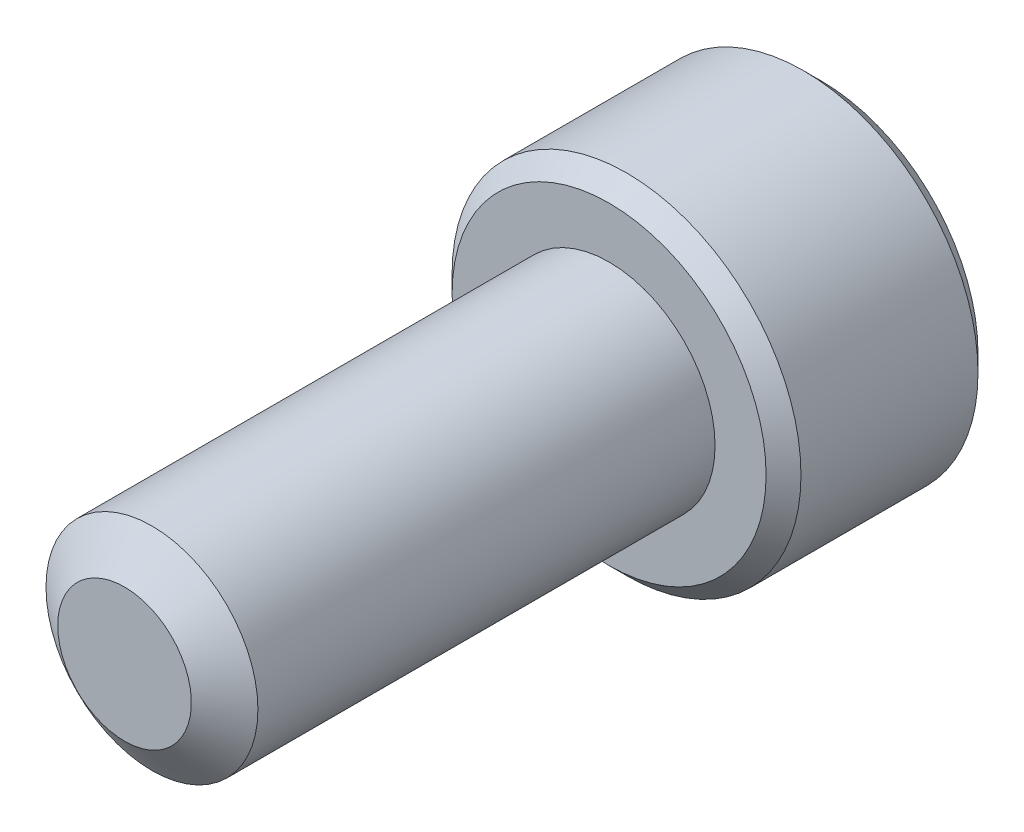
ISO-10303-21;
HEADER;
FILE_DESCRIPTION(('STEP AP214'),'2;1');
FILE_NAME('part.step','',(''),(''),'','','');
FILE_SCHEMA(('AUTOMOTIVE_DESIGN { 1 0 10303 214 1 1 1 1 }'));
ENDSEC;
DATA;
#1=APPLICATION_CONTEXT('core data for automotive mechanical design processes');
#2=APPLICATION_PROTOCOL_DEFINITION('international standard','automotive_design',2000,#1);
#3=PRODUCT_CONTEXT('',#1,'mechanical');
#4=PRODUCT('Part','Part','',(#3));
#5=PRODUCT_RELATED_PRODUCT_CATEGORY('part','',(#4));
#6=PRODUCT_DEFINITION_FORMATION('','',#4);
#7=PRODUCT_DEFINITION_CONTEXT('part definition',#1,'design');
#8=PRODUCT_DEFINITION('design','',#6,#7);
#9=PRODUCT_DEFINITION_SHAPE('','',#8);
#10=(LENGTH_UNIT() NAMED_UNIT(*) SI_UNIT(.MILLI.,.METRE.));
#11=(NAMED_UNIT(*) PLANE_ANGLE_UNIT() SI_UNIT($,.RADIAN.));
#12=(NAMED_UNIT(*) SI_UNIT($,.STERADIAN.) SOLID_ANGLE_UNIT());
#13=UNCERTAINTY_MEASURE_WITH_UNIT(LENGTH_MEASURE(1.E-05),#10,'distance_accuracy_value','');
#14=(GEOMETRIC_REPRESENTATION_CONTEXT(3) GLOBAL_UNCERTAINTY_ASSIGNED_CONTEXT((#13)) GLOBAL_UNIT_ASSIGNED_CONTEXT((#10,
#11,#12)) REPRESENTATION_CONTEXT('',''));
#15=CARTESIAN_POINT('',(0.,0.,0.));
#16=DIRECTION('',(0.,0.,1.));
#17=DIRECTION('',(1.,0.,0.));
#18=AXIS2_PLACEMENT_3D('',#15,#16,#17);
#19=CARTESIAN_POINT('',(-1.7859375,-1.03111149638085,-11.01169375));
#20=DIRECTION('',(-1.,0.,0.));
#21=DIRECTION('',(0.,-1.,0.));
#22=AXIS2_PLACEMENT_3D('',#19,#20,#21);
#23=PLANE('',#22);
#24=CARTESIAN_POINT('',(-1.78593749999427,1.03111149640045,-13.6905999999592));
#25=CARTESIAN_POINT('',(-1.78593749999794,0.96069492309963,-13.6554245652599));
#26=CARTESIAN_POINT('',(-1.78593749999945,0.889108487086667,-13.6223030291579));
#27=CARTESIAN_POINT('',(-1.78593750000056,0.743109337870881,-13.5615905844948));
#28=CARTESIAN_POINT('',(-1.78593750000015,0.66868144433279,-13.534036504538));
#29=CARTESIAN_POINT('',(-1.78593749999985,0.517674563679263,-13.4864565305287));
#30=CARTESIAN_POINT('',(-1.78593749999996,0.441103823295278,-13.4664051587036));
#31=CARTESIAN_POINT('',(-1.78593750000004,0.286283782128012,-13.4355352049639));
#32=CARTESIAN_POINT('',(-1.78593750000001,0.208040449600168,-13.4246880720215));
#33=CARTESIAN_POINT('',(-1.7859375,0.10792666946917,-13.4174419923261));
#34=CARTESIAN_POINT('',(-1.7859375,0.0863521599616257,-13.4162705279671));
#35=CARTESIAN_POINT('',(-1.7859375,0.0431861080408168,-13.4147066436146));
#36=CARTESIAN_POINT('',(-1.7859375,0.0215945812649161,-13.4143138004214));
#37=CARTESIAN_POINT('',(-1.7859375,-0.0541981545622529,-13.414316281021));
#38=CARTESIAN_POINT('',(-1.7859375,-0.108415549697065,-13.4167970706442));
#39=CARTESIAN_POINT('',(-1.7859375,-0.216427473854635,-13.426572896068));
#40=CARTESIAN_POINT('',(-1.7859375,-0.270221681438064,-13.4338712896901));
#41=CARTESIAN_POINT('',(-1.7859375,-0.430887377452918,-13.4625366064611));
#42=CARTESIAN_POINT('',(-1.7859375,-0.536587945955606,-13.4906688034401));
#43=CARTESIAN_POINT('',(-1.7859375,-0.707329338610803,-13.5482200322678));
#44=CARTESIAN_POINT('',(-1.7859375,-0.77376114881228,-13.5738111198643));
#45=CARTESIAN_POINT('',(-1.7859375,-0.904109359640365,-13.6292752635769));
#46=CARTESIAN_POINT('',(-1.7859375,-0.968043209897114,-13.6591070136854));
#47=CARTESIAN_POINT('',(-1.7859375,-1.03111149640136,-13.6905999999565));
#48=B_SPLINE_CURVE_WITH_KNOTS('',3,(#24,#25,#26,#27,#28,#29,#30,#31,#32,#33,#34,#35,#36,#37,#38,
#39,#40,#41,#42,#43,#44,#45,#46,#47),.UNSPECIFIED.,.F.,.F.,(4,2,2,2,2,2,2,2,2,2,2,4),(0.,
0.236303104656893,0.474121562194583,0.711124941876914,0.947390434639868,1.01219957258844,
1.07697347550657,1.23954324052721,1.40222643484617,1.72893676572138,1.94237217080048,
2.15385538573754),.UNSPECIFIED.);
#49=CARTESIAN_POINT('',(-1.78593750000903,1.03111149638606,-13.6905999999567));
#50=VERTEX_POINT('',#49);
#51=CARTESIAN_POINT('',(-1.78593750000903,-1.03111149638606,-13.6905999999567));
#52=VERTEX_POINT('',#51);
#53=EDGE_CURVE('E21',#50,#52,#48,.T.);
#54=ORIENTED_EDGE('',*,*,#53,.F.);
#55=DIRECTION('',(0.,0.,1.));
#56=VECTOR('',#55,1.);
#57=CARTESIAN_POINT('',(-1.7859375,1.03111149638085,-11.01169375));
#58=LINE('',#57,#56);
#59=CARTESIAN_POINT('',(-1.7859375,1.03111149638085,-11.01169375));
#60=VERTEX_POINT('',#59);
#61=EDGE_CURVE('E66',#50,#60,#58,.T.);
#62=ORIENTED_EDGE('',*,*,#61,.T.);
#63=DIRECTION('',(0.,1.,0.));
#64=VECTOR('',#63,1.);
#65=CARTESIAN_POINT('',(-1.7859375,3.09333448914254,-11.01169375));
#66=LINE('',#65,#64);
#67=CARTESIAN_POINT('',(-1.7859375,-1.03111149638085,-11.01169375));
#68=VERTEX_POINT('',#67);
#69=EDGE_CURVE('E71',#68,#60,#66,.T.);
#70=ORIENTED_EDGE('',*,*,#69,.F.);
#71=DIRECTION('',(0.,0.,1.));
#72=VECTOR('',#71,1.);
#73=CARTESIAN_POINT('',(-1.7859375,-1.03111149638085,-11.01169375));
#74=LINE('',#73,#72);
#75=EDGE_CURVE('E69',#68,#52,#74,.F.);
#76=ORIENTED_EDGE('',*,*,#75,.T.);
#77=EDGE_LOOP('',(#54,#62,#70,#76));
#78=FACE_BOUND('',#77,.T.);
#79=ADVANCED_FACE('F17',(#78),#23,.F.);
#80=CARTESIAN_POINT('',(1.7859375,3.09333448914254,-11.01169375));
#81=DIRECTION('',(0.,0.,-1.));
#82=DIRECTION('',(-1.,0.,0.));
#83=AXIS2_PLACEMENT_3D('',#80,#81,#82);
#84=PLANE('',#83);
#85=DIRECTION('',(0.866025403784439,-0.5,0.));
#86=VECTOR('',#85,1.);
#87=CARTESIAN_POINT('',(0.,-2.06222299276169,-11.01169375));
#88=LINE('',#87,#86);
#89=CARTESIAN_POINT('',(0.,-2.06222299276169,-11.01169375));
#90=VERTEX_POINT('',#89);
#91=EDGE_CURVE('E89',#90,#68,#88,.F.);
#92=ORIENTED_EDGE('',*,*,#91,.T.);
#93=ORIENTED_EDGE('',*,*,#69,.T.);
#94=DIRECTION('',(-0.866025403784439,-0.5,0.));
#95=VECTOR('',#94,1.);
#96=CARTESIAN_POINT('',(-1.7859375,1.03111149638085,-11.01169375));
#97=LINE('',#96,#95);
#98=CARTESIAN_POINT('',(0.,2.06222299276169,-11.01169375));
#99=VERTEX_POINT('',#98);
#100=EDGE_CURVE('E88',#60,#99,#97,.F.);
#101=ORIENTED_EDGE('',*,*,#100,.T.);
#102=DIRECTION('',(-0.866025403784439,0.5,0.));
#103=VECTOR('',#102,1.);
#104=CARTESIAN_POINT('',(0.,2.06222299276169,-11.01169375));
#105=LINE('',#104,#103);
#106=CARTESIAN_POINT('',(1.7859375,1.03111149638085,-11.01169375));
#107=VERTEX_POINT('',#106);
#108=EDGE_CURVE('E234',#99,#107,#105,.F.);
#109=ORIENTED_EDGE('',*,*,#108,.T.);
#110=DIRECTION('',(0.,1.,0.));
#111=VECTOR('',#110,1.);
#112=CARTESIAN_POINT('',(1.7859375,1.03111149638085,-11.01169375));
#113=LINE('',#112,#111);
#114=CARTESIAN_POINT('',(1.7859375,-1.03111149638085,-11.01169375));
#115=VERTEX_POINT('',#114);
#116=EDGE_CURVE('E239',#107,#115,#113,.F.);
#117=ORIENTED_EDGE('',*,*,#116,.T.);
#118=DIRECTION('',(0.866025403784439,0.5,0.));
#119=VECTOR('',#118,1.);
#120=CARTESIAN_POINT('',(1.7859375,-1.03111149638085,-11.01169375));
#121=LINE('',#120,#119);
#122=EDGE_CURVE('E244',#115,#90,#121,.F.);
#123=ORIENTED_EDGE('',*,*,#122,.T.);
#124=EDGE_LOOP('',(#92,#93,#101,#109,#117,#123));
#125=FACE_BOUND('',#124,.T.);
#126=ADVANCED_FACE('F169',(#125),#84,.T.);
#127=CARTESIAN_POINT('',(-1.7859375,1.03111149638085,-11.01169375));
#128=DIRECTION('',(-0.5,0.866025403784439,0.));
#129=DIRECTION('',(-0.866025403784439,-0.5,0.));
#130=AXIS2_PLACEMENT_3D('',#127,#128,#129);
#131=PLANE('',#130);
#132=CARTESIAN_POINT('',(-1.78593750001411,1.03111149636608,-13.6905999999592));
#133=CARTESIAN_POINT('',(-1.72455395597439,1.06655130204546,-13.6551942051056));
#134=CARTESIAN_POINT('',(-1.66214407774843,1.10258366204106,-13.6218681955787));
#135=CARTESIAN_POINT('',(-1.53488393140236,1.17605734179235,-13.5608496948344));
#136=CARTESIAN_POINT('',(-1.47002156744873,1.21350564508078,-13.5331911431967));
#137=CARTESIAN_POINT('',(-1.33922979223345,1.28901831170878,-13.4858118580637));
#138=CARTESIAN_POINT('',(-1.27333367173803,1.32706345461549,-13.4659720706649));
#139=CARTESIAN_POINT('',(-1.1400911301283,1.40399107188146,-13.4354050996975));
#140=CARTESIAN_POINT('',(-1.07274877645712,1.44287119790134,-13.4246551075935));
#141=CARTESIAN_POINT('',(-0.956681129260879,1.50988288525428,-13.4149555845176));
#142=CARTESIAN_POINT('',(-0.908105678910242,1.53792793459024,-13.4135201743401));
#143=CARTESIAN_POINT('',(-0.811034250952767,1.59397214965211,-13.4159415300536));
#144=CARTESIAN_POINT('',(-0.762538307165862,1.62197129585208,-13.4198001508996));
#145=CARTESIAN_POINT('',(-0.666017779714094,1.67769744835868,-13.4325882035003));
#146=CARTESIAN_POINT('',(-0.61799362749905,1.70542420556764,-13.4415219038154));
#147=CARTESIAN_POINT('',(-0.522749153321334,1.76041362837297,-13.4639751789819));
#148=CARTESIAN_POINT('',(-0.475529225039516,1.7876760666776,-13.4774969356366));
#149=CARTESIAN_POINT('',(-0.354627809589632,1.85747853143299,-13.5176243107403));
#150=CARTESIAN_POINT('',(-0.28169487520043,1.89958638073539,-13.5472499205808));
#151=CARTESIAN_POINT('',(-0.174452588465536,1.96150274385029,-13.5972605682831));
#152=CARTESIAN_POINT('',(-0.139111351020895,1.98190701680245,-13.6148317843476));
#153=CARTESIAN_POINT('',(-0.0690832544020717,2.02233775723616,-13.6515757306218));
#154=CARTESIAN_POINT('',(-0.0343960099453921,2.04236444716067,-13.6707474793284));
#155=CARTESIAN_POINT('',(1.89934080318623E-11,2.06222299277266,-13.6905999999572));
#156=B_SPLINE_CURVE_WITH_KNOTS('',3,(#132,#133,#134,#135,#136,#137,#138,#139,#140,#141,#142,
#143,#144,#145,#146,#147,#148,#149,#150,#151,#152,#153,#154,#155),.UNSPECIFIED.,.F.,.F.,(4,2,2,
2,2,2,2,2,2,2,2,4),(0.,0.237856418663216,0.477098096720969,0.712541425870698,0.94739220156694,
1.11547935104753,1.28362541097182,1.45191310543146,1.62028093980255,1.88754436627017,
2.02081355613943,2.15400161264314),.UNSPECIFIED.);
#157=CARTESIAN_POINT('',(-3.32158331044238E-12,2.06222299277478,-13.6905999999593));
#158=VERTEX_POINT('',#157);
#159=EDGE_CURVE('E85',#50,#158,#156,.T.);
#160=ORIENTED_EDGE('',*,*,#159,.T.);
#161=DIRECTION('',(0.,0.,1.));
#162=VECTOR('',#161,1.);
#163=CARTESIAN_POINT('',(0.,2.06222299276169,-11.01169375));
#164=LINE('',#163,#162);
#165=EDGE_CURVE('E96',#158,#99,#164,.T.);
#166=ORIENTED_EDGE('',*,*,#165,.T.);
#167=ORIENTED_EDGE('',*,*,#100,.F.);
#168=ORIENTED_EDGE('',*,*,#61,.F.);
#169=EDGE_LOOP('',(#160,#166,#167,#168));
#170=FACE_BOUND('',#169,.T.);
#171=ADVANCED_FACE('F83',(#170),#131,.F.);
#172=CARTESIAN_POINT('',(0.,-2.06222299276169,-11.01169375));
#173=DIRECTION('',(-0.5,-0.866025403784439,0.));
#174=DIRECTION('',(0.866025403784439,-0.5,0.));
#175=AXIS2_PLACEMENT_3D('',#172,#173,#174);
#176=PLANE('',#175);
#177=CARTESIAN_POINT('',(2.08708904245836E-11,-2.06222299276804,-13.6905999999596));
#178=CARTESIAN_POINT('',(-0.0613835440224515,-2.02678318709447,-13.6551942051061));
#179=CARTESIAN_POINT('',(-0.123793422249959,-1.99075082710123,-13.6218681955793));
#180=CARTESIAN_POINT('',(-0.2510535685973,-1.91727714735158,-13.5608496948348));
#181=CARTESIAN_POINT('',(-0.315915932550653,-1.87982884406243,-13.533191143197));
#182=CARTESIAN_POINT('',(-0.446707707765898,-1.80431617743383,-13.4858118580639));
#183=CARTESIAN_POINT('',(-0.51260382826155,-1.76627103452722,-13.465972070665));
#184=CARTESIAN_POINT('',(-0.645846369871614,-1.68934341726121,-13.4354050996975));
#185=CARTESIAN_POINT('',(-0.71318872354289,-1.65046329124121,-13.4246551075935));
#186=CARTESIAN_POINT('',(-0.829256370739265,-1.58345160388816,-13.4149555845176));
#187=CARTESIAN_POINT('',(-0.877831821089922,-1.55540655455221,-13.4135201743401));
#188=CARTESIAN_POINT('',(-0.974903249047429,-1.49936233949032,-13.4159415300537));
#189=CARTESIAN_POINT('',(-1.02339919283435,-1.47136319329034,-13.4198001508996));
#190=CARTESIAN_POINT('',(-1.11991972028614,-1.41563704078372,-13.4325882035003));
#191=CARTESIAN_POINT('',(-1.1679438725012,-1.38791028357476,-13.4415219038154));
#192=CARTESIAN_POINT('',(-1.26318834667893,-1.33292086076942,-13.463975178982));
#193=CARTESIAN_POINT('',(-1.31040827496076,-1.30565842246479,-13.4774969356367));
#194=CARTESIAN_POINT('',(-1.43130969041036,-1.23585595770955,-13.5176243107403));
#195=CARTESIAN_POINT('',(-1.50424262479928,-1.19374810840732,-13.5472499205807));
#196=CARTESIAN_POINT('',(-1.61148491153377,-1.13183174529265,-13.5972605682828));
#197=CARTESIAN_POINT('',(-1.64682614897828,-1.11142747234057,-13.6148317843472));
#198=CARTESIAN_POINT('',(-1.71685424559685,-1.070996731907,-13.6515757306212));
#199=CARTESIAN_POINT('',(-1.7515414900534,-1.05097004198257,-13.6707474793277));
#200=CARTESIAN_POINT('',(-1.78593750001766,-1.03111149637065,-13.6905999999564));
#201=B_SPLINE_CURVE_WITH_KNOTS('',3,(#177,#178,#179,#180,#181,#182,#183,#184,#185,#186,#187,
#188,#189,#190,#191,#192,#193,#194,#195,#196,#197,#198,#199,#200),.UNSPECIFIED.,.F.,.F.,(4,2,2,
2,2,2,2,2,2,2,2,4),(0.,0.237856418663647,0.477098096721859,0.712541425872056,0.947392201568754,
1.11547935104939,1.28362541097373,1.45191310543342,1.62028093980455,1.88754436627113,
2.02081355613988,2.15400161264308),.UNSPECIFIED.);
#202=CARTESIAN_POINT('',(0.,-2.06222299277286,-13.6905999999574));
#203=VERTEX_POINT('',#202);
#204=EDGE_CURVE('E95',#203,#52,#201,.T.);
#205=ORIENTED_EDGE('',*,*,#204,.T.);
#206=ORIENTED_EDGE('',*,*,#75,.F.);
#207=ORIENTED_EDGE('',*,*,#91,.F.);
#208=DIRECTION('',(0.,0.,1.));
#209=VECTOR('',#208,1.);
#210=CARTESIAN_POINT('',(0.,-2.06222299276169,-11.01169375));
#211=LINE('',#210,#209);
#212=EDGE_CURVE('E242',#90,#203,#211,.F.);
#213=ORIENTED_EDGE('',*,*,#212,.T.);
#214=EDGE_LOOP('',(#205,#206,#207,#213));
#215=FACE_BOUND('',#214,.T.);
#216=ADVANCED_FACE('F160',(#215),#176,.F.);
#217=CARTESIAN_POINT('',(1.7859375,-1.03111149638085,-11.01169375));
#218=DIRECTION('',(0.5,-0.866025403784439,0.));
#219=DIRECTION('',(0.866025403784439,0.5,0.));
#220=AXIS2_PLACEMENT_3D('',#217,#218,#219);
#221=PLANE('',#220);
#222=CARTESIAN_POINT('',(1.78593750001593,-1.03111149636595,-13.6905999999596));
#223=CARTESIAN_POINT('',(1.72455395597577,-1.066551302045,-13.6551942051061));
#224=CARTESIAN_POINT('',(1.66214407774956,-1.10258366204049,-13.6218681955793));
#225=CARTESIAN_POINT('',(1.53488393140317,-1.17605734179179,-13.5608496948348));
#226=CARTESIAN_POINT('',(1.47002156744947,-1.21350564508034,-13.533191143197));
#227=CARTESIAN_POINT('',(1.33922979223397,-1.2890183117085,-13.4858118580639));
#228=CARTESIAN_POINT('',(1.27333367173841,-1.32706345461527,-13.465972070665));
#229=CARTESIAN_POINT('',(1.14009113012842,-1.40399107188139,-13.4354050996975));
#230=CARTESIAN_POINT('',(1.07274877645711,-1.44287119790135,-13.4246551075935));
#231=CARTESIAN_POINT('',(0.956681129260728,-1.50988288525437,-13.4149555845176));
#232=CARTESIAN_POINT('',(0.908105678910076,-1.53792793459033,-13.4135201743401));
#233=CARTESIAN_POINT('',(0.811034250952573,-1.59397214965222,-13.4159415300537));
#234=CARTESIAN_POINT('',(0.762538307165654,-1.6219712958522,-13.4198001508996));
#235=CARTESIAN_POINT('',(0.666017779713861,-1.67769744835882,-13.4325882035003));
#236=CARTESIAN_POINT('',(0.617993627498805,-1.70542420556779,-13.4415219038154));
#237=CARTESIAN_POINT('',(0.522749153321068,-1.76041362837313,-13.463975178982));
#238=CARTESIAN_POINT('',(0.475529225039239,-1.78767606667776,-13.4774969356367));
#239=CARTESIAN_POINT('',(0.354627809589398,-1.85747853143313,-13.5176243107404));
#240=CARTESIAN_POINT('',(0.281694875200248,-1.89958638073549,-13.5472499205809));
#241=CARTESIAN_POINT('',(0.174452588465428,-1.96150274385035,-13.5972605682832));
#242=CARTESIAN_POINT('',(0.139111351020809,-1.9819070168025,-13.6148317843477));
#243=CARTESIAN_POINT('',(0.0690832544020305,-2.02233775723619,-13.6515757306219));
#244=CARTESIAN_POINT('',(0.0343960099453724,-2.04236444716068,-13.6707474793284));
#245=CARTESIAN_POINT('',(-1.89920481153364E-11,-2.06222299277266,-13.6905999999572));
#246=B_SPLINE_CURVE_WITH_KNOTS('',3,(#222,#223,#224,#225,#226,#227,#228,#229,#230,#231,#232,
#233,#234,#235,#236,#237,#238,#239,#240,#241,#242,#243,#244,#245),.UNSPECIFIED.,.F.,.F.,(4,2,2,
2,2,2,2,2,2,2,2,4),(0.,0.237856418663652,0.477098096721868,0.712541425872061,0.947392201568756,
1.11547935104939,1.28362541097373,1.45191310543342,1.62028093980456,1.88754436627199,
2.02081355614117,2.1540016126448),.UNSPECIFIED.);
#247=CARTESIAN_POINT('',(1.78593750000967,-1.03111149638643,-13.6905999999574));
#248=VERTEX_POINT('',#247);
#249=EDGE_CURVE('E143',#248,#203,#246,.T.);
#250=ORIENTED_EDGE('',*,*,#249,.T.);
#251=ORIENTED_EDGE('',*,*,#212,.F.);
#252=ORIENTED_EDGE('',*,*,#122,.F.);
#253=DIRECTION('',(0.,0.,1.));
#254=VECTOR('',#253,1.);
#255=CARTESIAN_POINT('',(1.7859375,-1.03111149638085,-11.01169375));
#256=LINE('',#255,#254);
#257=EDGE_CURVE('E237',#115,#248,#256,.F.);
#258=ORIENTED_EDGE('',*,*,#257,.T.);
#259=EDGE_LOOP('',(#250,#251,#252,#258));
#260=FACE_BOUND('',#259,.T.);
#261=ADVANCED_FACE('F156',(#260),#221,.F.);
#262=CARTESIAN_POINT('',(1.7859375,1.03111149638085,-11.01169375));
#263=DIRECTION('',(1.,0.,0.));
#264=DIRECTION('',(0.,1.,0.));
#265=AXIS2_PLACEMENT_3D('',#262,#263,#264);
#266=PLANE('',#265);
#267=CARTESIAN_POINT('',(1.78593749999506,1.0311114964021,-13.6905999999596));
#268=CARTESIAN_POINT('',(1.78593749999822,0.96023188503695,-13.6551942051071));
#269=CARTESIAN_POINT('',(1.78593749999952,0.888167165035615,-13.6218681955817));
#270=CARTESIAN_POINT('',(1.78593750000048,0.741219805509484,-13.5608496948416));
#271=CARTESIAN_POINT('',(1.78593750000013,0.666323198919208,-13.5331911432067));
#272=CARTESIAN_POINT('',(1.78593749999987,0.515297865637936,-13.485811858081));
#273=CARTESIAN_POINT('',(1.78593749999997,0.439207579812643,-13.4659720706867));
#274=CARTESIAN_POINT('',(1.78593750000003,0.285352345257304,-13.4354050997299));
#275=CARTESIAN_POINT('',(1.78593750000001,0.207592093206035,-13.4246551076319));
#276=CARTESIAN_POINT('',(1.78593749999999,0.0735687184737558,-13.4149555845669));
#277=CARTESIAN_POINT('',(1.7859375,0.017478619786673,-13.4135201743946));
#278=CARTESIAN_POINT('',(1.7859375,-0.0946098103668712,-13.4159415301202));
#279=CARTESIAN_POINT('',(1.7859375,-0.150608102781438,-13.419800150973));
#280=CARTESIAN_POINT('',(1.7859375,-0.262060407823213,-13.4325882035887));
#281=CARTESIAN_POINT('',(1.7859375,-0.317513922255084,-13.4415219039119));
#282=CARTESIAN_POINT('',(1.7859375,-0.427492767893014,-13.4639751790954));
#283=CARTESIAN_POINT('',(1.7859375,-0.482017644515583,-13.4774969357589));
#284=CARTESIAN_POINT('',(1.7859375,-0.621622573982271,-13.5176243108634));
#285=CARTESIAN_POINT('',(1.7859375,-0.705838272531852,-13.547249920687));
#286=CARTESIAN_POINT('',(1.7859375,-0.82967099868264,-13.5972605683552));
#287=CARTESIAN_POINT('',(1.7859375,-0.870479544561167,-13.6148317844068));
#288=CARTESIAN_POINT('',(1.7859375,-0.951341025378301,-13.651575730653));
#289=CARTESIAN_POINT('',(1.7859375,-0.991394405202812,-13.6707474793444));
#290=CARTESIAN_POINT('',(1.7859375,-1.03111149640278,-13.6905999999572));
#291=B_SPLINE_CURVE_WITH_KNOTS('',3,(#267,#268,#269,#270,#271,#272,#273,#274,#275,#276,#277,
#278,#279,#280,#281,#282,#283,#284,#285,#286,#287,#288,#289,#290),.UNSPECIFIED.,.F.,.F.,(4,2,2,
2,2,2,2,2,2,2,2,4),(0.,0.237856418695993,0.477098096786559,0.712541425967802,0.947392201695522,
1.11547935122114,1.28362541119053,1.45191310569533,1.62028094011156,1.88754436640769,
2.02081355619067,2.15400161260849),.UNSPECIFIED.);
#292=CARTESIAN_POINT('',(1.78593750000967,1.03111149638643,-13.6905999999574));
#293=VERTEX_POINT('',#292);
#294=EDGE_CURVE('E105',#293,#248,#291,.T.);
#295=ORIENTED_EDGE('',*,*,#294,.T.);
#296=ORIENTED_EDGE('',*,*,#257,.F.);
#297=ORIENTED_EDGE('',*,*,#116,.F.);
#298=DIRECTION('',(0.,0.,1.));
#299=VECTOR('',#298,1.);
#300=CARTESIAN_POINT('',(1.7859375,1.03111149638085,-11.01169375));
#301=LINE('',#300,#299);
#302=EDGE_CURVE('E41',#107,#293,#301,.F.);
#303=ORIENTED_EDGE('',*,*,#302,.T.);
#304=EDGE_LOOP('',(#295,#296,#297,#303));
#305=FACE_BOUND('',#304,.T.);
#306=ADVANCED_FACE('F159',(#305),#266,.F.);
#307=CARTESIAN_POINT('',(0.,2.06222299276169,-11.01169375));
#308=DIRECTION('',(0.5,0.866025403784439,0.));
#309=DIRECTION('',(-0.866025403784439,0.5,0.));
#310=AXIS2_PLACEMENT_3D('',#307,#308,#309);
#311=PLANE('',#310);
#312=CARTESIAN_POINT('',(-2.08696839220087E-11,2.06222299276804,-13.6905999999596));
#313=CARTESIAN_POINT('',(0.0613835440224534,2.02678318709447,-13.6551942051061));
#314=CARTESIAN_POINT('',(0.123793422249962,1.99075082710122,-13.6218681955793));
#315=CARTESIAN_POINT('',(0.251053568597306,1.91727714735158,-13.5608496948348));
#316=CARTESIAN_POINT('',(0.315915932550659,1.87982884406243,-13.533191143197));
#317=CARTESIAN_POINT('',(0.446707707765905,1.80431617743382,-13.4858118580639));
#318=CARTESIAN_POINT('',(0.512603828261555,1.76627103452721,-13.465972070665));
#319=CARTESIAN_POINT('',(0.645846369871617,1.68934341726121,-13.4354050996975));
#320=CARTESIAN_POINT('',(0.713188723542892,1.65046329124121,-13.4246551075935));
#321=CARTESIAN_POINT('',(0.829256370739266,1.58345160388816,-13.4149555845176));
#322=CARTESIAN_POINT('',(0.877831821089921,1.55540655455221,-13.4135201743401));
#323=CARTESIAN_POINT('',(0.974903249047428,1.49936233949032,-13.4159415300537));
#324=CARTESIAN_POINT('',(1.02339919283435,1.47136319329034,-13.4198001508996));
#325=CARTESIAN_POINT('',(1.11991972028614,1.41563704078372,-13.4325882035003));
#326=CARTESIAN_POINT('',(1.16794387250119,1.38791028357476,-13.4415219038154));
#327=CARTESIAN_POINT('',(1.26318834667893,1.33292086076942,-13.463975178982));
#328=CARTESIAN_POINT('',(1.31040827496076,1.30565842246479,-13.4774969356367));
#329=CARTESIAN_POINT('',(1.4313096904106,1.23585595770941,-13.5176243107404));
#330=CARTESIAN_POINT('',(1.50424262479975,1.19374810840705,-13.5472499205809));
#331=CARTESIAN_POINT('',(1.61148491153457,1.13183174529219,-13.5972605682832));
#332=CARTESIAN_POINT('',(1.64682614897919,1.11142747234004,-13.6148317843477));
#333=CARTESIAN_POINT('',(1.71685424559797,1.07099673190636,-13.6515757306219));
#334=CARTESIAN_POINT('',(1.75154149005463,1.05097004198186,-13.6707474793284));
#335=CARTESIAN_POINT('',(1.78593750001899,1.03111149636988,-13.6905999999572));
#336=B_SPLINE_CURVE_WITH_KNOTS('',3,(#312,#313,#314,#315,#316,#317,#318,#319,#320,#321,#322,
#323,#324,#325,#326,#327,#328,#329,#330,#331,#332,#333,#334,#335),.UNSPECIFIED.,.F.,.F.,(4,2,2,
2,2,2,2,2,2,2,2,4),(0.,0.237856418663652,0.477098096721867,0.71254142587206,0.947392201568754,
1.11547935104939,1.28362541097373,1.45191310543342,1.62028093980455,1.88754436627199,
2.02081355614117,2.1540016126448),.UNSPECIFIED.);
#337=EDGE_CURVE('E103',#158,#293,#336,.T.);
#338=ORIENTED_EDGE('',*,*,#337,.T.);
#339=ORIENTED_EDGE('',*,*,#302,.F.);
#340=ORIENTED_EDGE('',*,*,#108,.F.);
#341=ORIENTED_EDGE('',*,*,#165,.F.);
#342=EDGE_LOOP('',(#338,#339,#340,#341));
#343=FACE_BOUND('',#342,.T.);
#344=ADVANCED_FACE('F122',(#343),#311,.F.);
#345=CARTESIAN_POINT('',(0.,0.,-13.6905999999044));
#346=DIRECTION('',(0.,0.,-1.));
#347=DIRECTION('',(-1.,0.,0.));
#348=AXIS2_PLACEMENT_3D('',#345,#346,#347);
#349=CONICAL_SURFACE('',#348,2.06222299271985,0.785398163397448);
#350=ORIENTED_EDGE('',*,*,#159,.F.);
#351=CARTESIAN_POINT('',(0.,0.,-13.6905999999613));
#352=DIRECTION('',(0.,0.,-1.));
#353=DIRECTION('',(-1.,0.,0.));
#354=AXIS2_PLACEMENT_3D('',#351,#352,#353);
#355=CIRCLE('',#354,2.0622229927767);
#356=EDGE_CURVE('E79',#158,#50,#355,.F.);
#357=ORIENTED_EDGE('',*,*,#356,.F.);
#358=EDGE_LOOP('',(#350,#357));
#359=FACE_BOUND('',#358,.T.);
#360=ADVANCED_FACE('F93',(#359),#349,.F.);
#361=CARTESIAN_POINT('',(0.,0.,-13.6905999999044));
#362=DIRECTION('',(0.,0.,-1.));
#363=DIRECTION('',(-1.,0.,0.));
#364=AXIS2_PLACEMENT_3D('',#361,#362,#363);
#365=CONICAL_SURFACE('',#364,2.06222299271985,0.785398163397448);
#366=ORIENTED_EDGE('',*,*,#53,.T.);
#367=CARTESIAN_POINT('',(0.,0.,-13.6905999999613));
#368=DIRECTION('',(0.,0.,-1.));
#369=DIRECTION('',(-1.,0.,0.));
#370=AXIS2_PLACEMENT_3D('',#367,#368,#369);
#371=CIRCLE('',#370,2.0622229927767);
#372=EDGE_CURVE('E73',#50,#52,#371,.F.);
#373=ORIENTED_EDGE('',*,*,#372,.F.);
#374=EDGE_LOOP('',(#366,#373));
#375=FACE_BOUND('',#374,.T.);
#376=ADVANCED_FACE('F74',(#375),#365,.F.);
#377=CARTESIAN_POINT('',(0.,0.,-13.6905999999044));
#378=DIRECTION('',(0.,0.,-1.));
#379=DIRECTION('',(-1.,0.,0.));
#380=AXIS2_PLACEMENT_3D('',#377,#378,#379);
#381=CONICAL_SURFACE('',#380,2.06222299271985,0.785398163397448);
#382=ORIENTED_EDGE('',*,*,#204,.F.);
#383=CARTESIAN_POINT('',(0.,0.,-13.6905999999613));
#384=DIRECTION('',(0.,0.,-1.));
#385=DIRECTION('',(-1.,0.,0.));
#386=AXIS2_PLACEMENT_3D('',#383,#384,#385);
#387=CIRCLE('',#386,2.0622229927767);
#388=EDGE_CURVE('E78',#52,#203,#387,.F.);
#389=ORIENTED_EDGE('',*,*,#388,.F.);
#390=EDGE_LOOP('',(#382,#389));
#391=FACE_BOUND('',#390,.T.);
#392=ADVANCED_FACE('F140',(#391),#381,.F.);
#393=CARTESIAN_POINT('',(0.,0.,-13.6905999999044));
#394=DIRECTION('',(0.,0.,-1.));
#395=DIRECTION('',(-1.,0.,0.));
#396=AXIS2_PLACEMENT_3D('',#393,#394,#395);
#397=CONICAL_SURFACE('',#396,2.06222299271985,0.785398163397448);
#398=ORIENTED_EDGE('',*,*,#249,.F.);
#399=CARTESIAN_POINT('',(0.,0.,-13.6905999999613));
#400=DIRECTION('',(0.,0.,-1.));
#401=DIRECTION('',(-1.,0.,0.));
#402=AXIS2_PLACEMENT_3D('',#399,#400,#401);
#403=CIRCLE('',#402,2.0622229927767);
#404=EDGE_CURVE('E285',#203,#248,#403,.F.);
#405=ORIENTED_EDGE('',*,*,#404,.F.);
#406=EDGE_LOOP('',(#398,#405));
#407=FACE_BOUND('',#406,.T.);
#408=ADVANCED_FACE('F135',(#407),#397,.F.);
#409=CARTESIAN_POINT('',(0.,0.,-13.6905999999044));
#410=DIRECTION('',(0.,0.,-1.));
#411=DIRECTION('',(-1.,0.,0.));
#412=AXIS2_PLACEMENT_3D('',#409,#410,#411);
#413=CONICAL_SURFACE('',#412,2.06222299271985,0.785398163499701);
#414=ORIENTED_EDGE('',*,*,#294,.F.);
#415=CARTESIAN_POINT('',(0.,0.,-13.6905999999613));
#416=DIRECTION('',(0.,0.,-1.));
#417=DIRECTION('',(-1.,0.,0.));
#418=AXIS2_PLACEMENT_3D('',#415,#416,#417);
#419=CIRCLE('',#418,2.0622229927767);
#420=EDGE_CURVE('E283',#248,#293,#419,.F.);
#421=ORIENTED_EDGE('',*,*,#420,.F.);
#422=EDGE_LOOP('',(#414,#421));
#423=FACE_BOUND('',#422,.T.);
#424=ADVANCED_FACE('F129',(#423),#413,.F.);
#425=CARTESIAN_POINT('',(0.,0.,-13.6905999999044));
#426=DIRECTION('',(0.,0.,-1.));
#427=DIRECTION('',(-1.,0.,0.));
#428=AXIS2_PLACEMENT_3D('',#425,#426,#427);
#429=CONICAL_SURFACE('',#428,2.06222299271985,0.785398163397448);
#430=ORIENTED_EDGE('',*,*,#337,.F.);
#431=CARTESIAN_POINT('',(0.,0.,-13.6905999999613));
#432=DIRECTION('',(0.,0.,-1.));
#433=DIRECTION('',(-1.,0.,0.));
#434=AXIS2_PLACEMENT_3D('',#431,#432,#433);
#435=CIRCLE('',#434,2.0622229927767);
#436=EDGE_CURVE('E102',#293,#158,#435,.F.);
#437=ORIENTED_EDGE('',*,*,#436,.F.);
#438=EDGE_LOOP('',(#430,#437));
#439=FACE_BOUND('',#438,.T.);
#440=ADVANCED_FACE('F125',(#439),#429,.F.);
#441=CARTESIAN_POINT('',(0.,0.,-13.6906));
#442=DIRECTION('',(0.,0.,-1.));
#443=DIRECTION('',(-1.,0.,0.));
#444=AXIS2_PLACEMENT_3D('',#441,#442,#443);
#445=PLANE('',#444);
#446=ORIENTED_EDGE('',*,*,#420,.T.);
#447=ORIENTED_EDGE('',*,*,#436,.T.);
#448=ORIENTED_EDGE('',*,*,#356,.T.);
#449=ORIENTED_EDGE('',*,*,#372,.T.);
#450=ORIENTED_EDGE('',*,*,#388,.T.);
#451=ORIENTED_EDGE('',*,*,#404,.T.);
#452=EDGE_LOOP('',(#446,#447,#448,#449,#450,#451));
#453=FACE_BOUND('',#452,.T.);
#454=CARTESIAN_POINT('',(0.,0.,-13.6906000000181));
#455=DIRECTION('',(0.,0.,1.));
#456=DIRECTION('',(0.,-1.,0.));
#457=AXIS2_PLACEMENT_3D('',#454,#455,#456);
#458=CIRCLE('',#457,3.08610000001863);
#459=CARTESIAN_POINT('',(0.,-3.08610000001863,-13.6906000000181));
#460=VERTEX_POINT('',#459);
#461=EDGE_CURVE('E219',#460,#460,#458,.T.);
#462=ORIENTED_EDGE('',*,*,#461,.F.);
#463=EDGE_LOOP('',(#462));
#464=FACE_BOUND('',#463,.T.);
#465=ADVANCED_FACE('F99',(#453,#464),#445,.T.);
#466=CARTESIAN_POINT('',(0.,0.,-13.3476999999402));
#467=DIRECTION('',(0.,0.,1.));
#468=DIRECTION('',(0.,-1.,0.));
#469=AXIS2_PLACEMENT_3D('',#466,#467,#468);
#470=CONICAL_SURFACE('',#469,3.42900000009649,0.785398163397448);
#471=ORIENTED_EDGE('',*,*,#461,.T.);
#472=EDGE_LOOP('',(#471));
#473=FACE_BOUND('',#472,.T.);
#474=CARTESIAN_POINT('',(0.,0.,-13.3477));
#475=DIRECTION('',(0.,0.,1.));
#476=DIRECTION('',(1.,0.,0.));
#477=AXIS2_PLACEMENT_3D('',#474,#475,#476);
#478=CIRCLE('',#477,3.429);
#479=CARTESIAN_POINT('',(3.429,0.,-13.3477));
#480=VERTEX_POINT('',#479);
#481=EDGE_CURVE('E222',#480,#480,#478,.T.);
#482=ORIENTED_EDGE('',*,*,#481,.F.);
#483=EDGE_LOOP('',(#482));
#484=FACE_BOUND('',#483,.T.);
#485=ADVANCED_FACE('F209',(#473,#484),#470,.T.);
#486=CARTESIAN_POINT('',(0.,0.,-13.6906));
#487=DIRECTION('',(0.,0.,1.));
#488=DIRECTION('',(1.,0.,0.));
#489=AXIS2_PLACEMENT_3D('',#486,#487,#488);
#490=CYLINDRICAL_SURFACE('',#489,3.429);
#491=ORIENTED_EDGE('',*,*,#481,.T.);
#492=EDGE_LOOP('',(#491));
#493=FACE_BOUND('',#492,.T.);
#494=CARTESIAN_POINT('',(0.,0.,-9.86790000007431));
#495=DIRECTION('',(0.,0.,-1.));
#496=DIRECTION('',(-1.,0.,0.));
#497=AXIS2_PLACEMENT_3D('',#494,#495,#496);
#498=CIRCLE('',#497,3.42899999998281);
#499=CARTESIAN_POINT('',(-3.42899999998281,0.,-9.86790000007431));
#500=VERTEX_POINT('',#499);
#501=EDGE_CURVE('E223',#500,#500,#498,.F.);
#502=ORIENTED_EDGE('',*,*,#501,.F.);
#503=EDGE_LOOP('',(#502));
#504=FACE_BOUND('',#503,.T.);
#505=ADVANCED_FACE('F206',(#493,#504),#490,.T.);
#506=CARTESIAN_POINT('',(0.,0.,-9.86790000007431));
#507=DIRECTION('',(0.,0.,-1.));
#508=DIRECTION('',(-1.,0.,0.));
#509=AXIS2_PLACEMENT_3D('',#506,#507,#508);
#510=CONICAL_SURFACE('',#509,3.42899999998281,0.785398163397448);
#511=CARTESIAN_POINT('',(0.,0.,-9.5250000000533));
#512=DIRECTION('',(0.,0.,-1.));
#513=DIRECTION('',(-1.,0.,0.));
#514=AXIS2_PLACEMENT_3D('',#511,#512,#513);
#515=CIRCLE('',#514,3.08609999996179);
#516=CARTESIAN_POINT('',(-3.08609999996179,0.,-9.5250000000533));
#517=VERTEX_POINT('',#516);
#518=EDGE_CURVE('E226',#517,#517,#515,.T.);
#519=ORIENTED_EDGE('',*,*,#518,.T.);
#520=EDGE_LOOP('',(#519));
#521=FACE_BOUND('',#520,.T.);
#522=ORIENTED_EDGE('',*,*,#501,.T.);
#523=EDGE_LOOP('',(#522));
#524=FACE_BOUND('',#523,.T.);
#525=ADVANCED_FACE('F202',(#521,#524),#510,.T.);
#526=CARTESIAN_POINT('',(0.,0.,0.));
#527=DIRECTION('',(0.,0.,1.));
#528=DIRECTION('',(1.,0.,0.));
#529=AXIS2_PLACEMENT_3D('',#526,#527,#528);
#530=PLANE('',#529);
#531=CARTESIAN_POINT('',(0.,0.,0.));
#532=DIRECTION('',(0.,0.,-1.));
#533=DIRECTION('',(-1.,0.,0.));
#534=AXIS2_PLACEMENT_3D('',#531,#532,#533);
#535=CIRCLE('',#534,1.31324425183266);
#536=CARTESIAN_POINT('',(-1.31324425183266,0.,0.));
#537=VERTEX_POINT('',#536);
#538=EDGE_CURVE('E277',#537,#537,#535,.T.);
#539=ORIENTED_EDGE('',*,*,#538,.F.);
#540=EDGE_LOOP('',(#539));
#541=FACE_BOUND('',#540,.T.);
#542=ADVANCED_FACE('F198',(#541),#530,.T.);
#543=CARTESIAN_POINT('',(0.,0.,-9.525));
#544=DIRECTION('',(0.,0.,-1.));
#545=DIRECTION('',(-1.,0.,0.));
#546=AXIS2_PLACEMENT_3D('',#543,#544,#545);
#547=PLANE('',#546);
#548=CARTESIAN_POINT('',(0.,0.,-9.525));
#549=DIRECTION('',(0.,0.,1.));
#550=DIRECTION('',(1.,0.,0.));
#551=AXIS2_PLACEMENT_3D('',#548,#549,#550);
#552=CIRCLE('',#551,2.0828);
#553=CARTESIAN_POINT('',(2.0828,0.,-9.525));
#554=VERTEX_POINT('',#553);
#555=EDGE_CURVE('E32',#554,#554,#552,.T.);
#556=ORIENTED_EDGE('',*,*,#555,.F.);
#557=EDGE_LOOP('',(#556));
#558=FACE_BOUND('',#557,.T.);
#559=ORIENTED_EDGE('',*,*,#518,.F.);
#560=EDGE_LOOP('',(#559));
#561=FACE_BOUND('',#560,.T.);
#562=ADVANCED_FACE('F191',(#558,#561),#547,.F.);
#563=CARTESIAN_POINT('',(0.,0.,-0.53884873602783));
#564=DIRECTION('',(0.,0.,-1.));
#565=DIRECTION('',(-1.,0.,0.));
#566=AXIS2_PLACEMENT_3D('',#563,#564,#565);
#567=CONICAL_SURFACE('',#566,2.08280000003924,0.959931088543722);
#568=CARTESIAN_POINT('',(0.,0.,-0.538848735955548));
#569=DIRECTION('',(0.,0.,1.));
#570=DIRECTION('',(1.,0.,0.));
#571=AXIS2_PLACEMENT_3D('',#568,#569,#570);
#572=CIRCLE('',#571,2.0828);
#573=CARTESIAN_POINT('',(2.0828,0.,-0.538848735955548));
#574=VERTEX_POINT('',#573);
#575=EDGE_CURVE('E11',#574,#574,#572,.F.);
#576=ORIENTED_EDGE('',*,*,#575,.F.);
#577=EDGE_LOOP('',(#576));
#578=FACE_BOUND('',#577,.T.);
#579=ORIENTED_EDGE('',*,*,#538,.T.);
#580=EDGE_LOOP('',(#579));
#581=FACE_BOUND('',#580,.T.);
#582=ADVANCED_FACE('F185',(#578,#581),#567,.T.);
#583=CARTESIAN_POINT('',(0.,0.,-9.525));
#584=DIRECTION('',(0.,0.,1.));
#585=DIRECTION('',(1.,0.,0.));
#586=AXIS2_PLACEMENT_3D('',#583,#584,#585);
#587=CYLINDRICAL_SURFACE('',#586,2.0828);
#588=ORIENTED_EDGE('',*,*,#575,.T.);
#589=EDGE_LOOP('',(#588));
#590=FACE_BOUND('',#589,.T.);
#591=ORIENTED_EDGE('',*,*,#555,.T.);
#592=EDGE_LOOP('',(#591));
#593=FACE_BOUND('',#592,.T.);
#594=ADVANCED_FACE('F183',(#590,#593),#587,.T.);
#595=CLOSED_SHELL('',(#79,#126,#171,#216,#261,#306,#344,#360,#376,#392,#408,#424,#440,#465,#485,
#505,#525,#542,#562,#582,#594));
#596=MANIFOLD_SOLID_BREP('B1',#595);
#597=ADVANCED_BREP_SHAPE_REPRESENTATION('',(#18,#596),#14);
#598=SHAPE_DEFINITION_REPRESENTATION(#9,#597);
ENDSEC;
END-ISO-10303-21;
